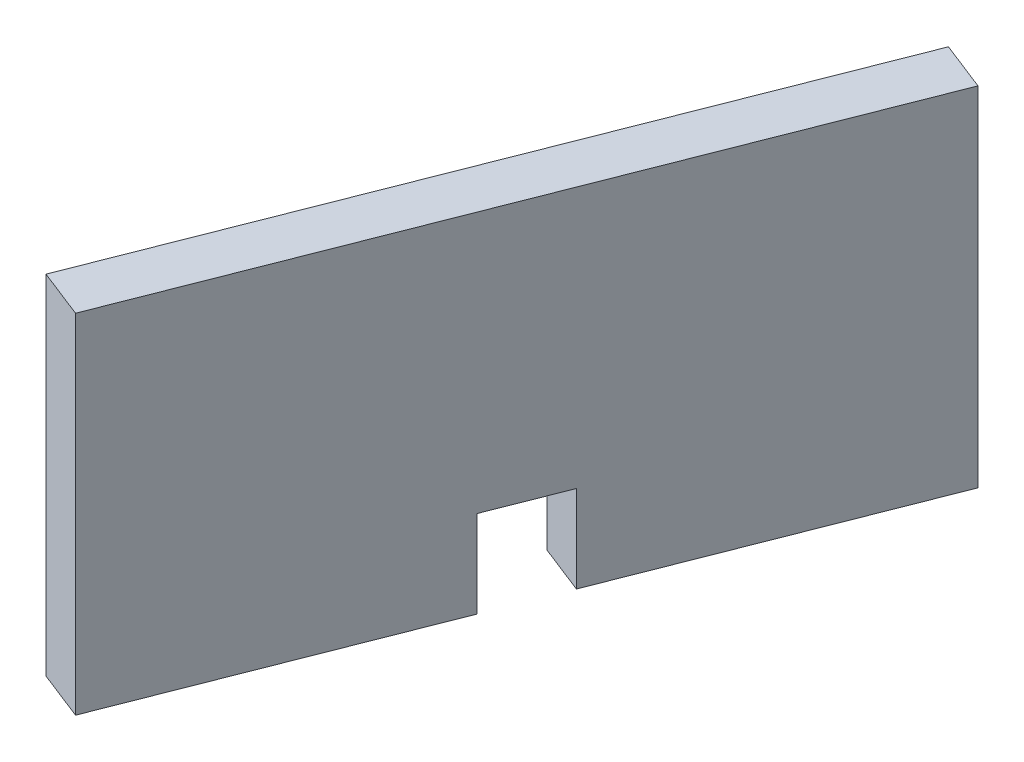
ISO-10303-21;
HEADER;
FILE_DESCRIPTION(('STEP AP214'),'2;1');
FILE_NAME('part.step','',(''),(''),'','','');
FILE_SCHEMA(('AUTOMOTIVE_DESIGN { 1 0 10303 214 1 1 1 1 }'));
ENDSEC;
DATA;
#1=APPLICATION_CONTEXT('core data for automotive mechanical design processes');
#2=APPLICATION_PROTOCOL_DEFINITION('international standard','automotive_design',2000,#1);
#3=PRODUCT_CONTEXT('',#1,'mechanical');
#4=PRODUCT('Part','Part','',(#3));
#5=PRODUCT_RELATED_PRODUCT_CATEGORY('part','',(#4));
#6=PRODUCT_DEFINITION_FORMATION('','',#4);
#7=PRODUCT_DEFINITION_CONTEXT('part definition',#1,'design');
#8=PRODUCT_DEFINITION('design','',#6,#7);
#9=PRODUCT_DEFINITION_SHAPE('','',#8);
#10=(LENGTH_UNIT() NAMED_UNIT(*) SI_UNIT(.MILLI.,.METRE.));
#11=(NAMED_UNIT(*) PLANE_ANGLE_UNIT() SI_UNIT($,.RADIAN.));
#12=(NAMED_UNIT(*) SI_UNIT($,.STERADIAN.) SOLID_ANGLE_UNIT());
#13=UNCERTAINTY_MEASURE_WITH_UNIT(LENGTH_MEASURE(1.E-05),#10,'distance_accuracy_value','');
#14=(GEOMETRIC_REPRESENTATION_CONTEXT(3) GLOBAL_UNCERTAINTY_ASSIGNED_CONTEXT((#13)) GLOBAL_UNIT_ASSIGNED_CONTEXT((#10,
#11,#12)) REPRESENTATION_CONTEXT('',''));
#15=CARTESIAN_POINT('',(0.,0.,0.));
#16=DIRECTION('',(0.,0.,1.));
#17=DIRECTION('',(1.,0.,0.));
#18=AXIS2_PLACEMENT_3D('',#15,#16,#17);
#19=CARTESIAN_POINT('',(43.5119887165098,200.000000000018,-90.3490832158114));
#20=DIRECTION('',(0.,0.999999999999994,2.17659222283696E-13));
#21=DIRECTION('',(0.930888575458414,-1.30395694242225E-13,0.36530324400573));
#22=AXIS2_PLACEMENT_3D('',#19,#20,#21);
#23=PLANE('',#22);
#24=DIRECTION('',(-0.365303244005823,-1.48298311564848E-13,0.930888575458446));
#25=VECTOR('',#24,1.);
#26=CARTESIAN_POINT('',(29.5486600846357,200.000000000025,-95.8286318758929));
#27=LINE('',#26,#25);
#28=CARTESIAN_POINT('',(-11.0000000000138,200.000000000015,7.4999999999974));
#29=VERTEX_POINT('',#28);
#30=CARTESIAN_POINT('',(-43.5119887165312,200.000000000017,90.3490832158025));
#31=VERTEX_POINT('',#30);
#32=EDGE_CURVE('E49',#29,#31,#27,.T.);
#33=ORIENTED_EDGE('',*,*,#32,.F.);
#34=DIRECTION('',(0.930888575458414,-1.30395694242225E-13,0.36530324400573));
#35=VECTOR('',#34,1.);
#36=CARTESIAN_POINT('',(-11.0000000000138,200.000000000015,7.4999999999974));
#37=LINE('',#36,#35);
#38=CARTESIAN_POINT('',(2.96332863186205,200.000000000004,12.9795486600816));
#39=VERTEX_POINT('',#38);
#40=EDGE_CURVE('E116',#29,#39,#37,.T.);
#41=ORIENTED_EDGE('',*,*,#40,.T.);
#42=DIRECTION('',(-0.365303244005823,-1.48298311564848E-13,0.930888575458446));
#43=VECTOR('',#42,1.);
#44=CARTESIAN_POINT('',(43.5119887165098,200.000000000018,-90.3490832158114));
#45=LINE('',#44,#43);
#46=CARTESIAN_POINT('',(-29.5486600846598,199.99999999998,95.8286318758849));
#47=VERTEX_POINT('',#46);
#48=EDGE_CURVE('E87',#39,#47,#45,.T.);
#49=ORIENTED_EDGE('',*,*,#48,.T.);
#50=DIRECTION('',(-0.930888575458414,1.30395694242225E-13,-0.36530324400573));
#51=VECTOR('',#50,1.);
#52=CARTESIAN_POINT('',(-29.5486600846598,199.99999999998,95.8286318758849));
#53=LINE('',#52,#51);
#54=EDGE_CURVE('E136',#47,#31,#53,.T.);
#55=ORIENTED_EDGE('',*,*,#54,.T.);
#56=EDGE_LOOP('',(#33,#41,#49,#55));
#57=FACE_BOUND('',#56,.T.);
#58=ADVANCED_FACE('F40',(#57),#23,.F.);
#59=CARTESIAN_POINT('',(43.5119887165098,200.000000000018,-90.3490832158114));
#60=VERTEX_POINT('',#59);
#61=CARTESIAN_POINT('',(10.9999999999851,199.99999999999,-7.50000000000539));
#62=VERTEX_POINT('',#61);
#63=EDGE_CURVE('E149',#60,#62,#45,.T.);
#64=ORIENTED_EDGE('',*,*,#63,.T.);
#65=DIRECTION('',(0.930888575458414,-1.30395694242225E-13,0.36530324400573));
#66=VECTOR('',#65,1.);
#67=CARTESIAN_POINT('',(-2.96332863188514,200.000000000013,-12.9795486600867));
#68=LINE('',#67,#66);
#69=CARTESIAN_POINT('',(-2.96332863188514,200.000000000013,-12.9795486600867));
#70=VERTEX_POINT('',#69);
#71=EDGE_CURVE('E56',#70,#62,#68,.T.);
#72=ORIENTED_EDGE('',*,*,#71,.F.);
#73=CARTESIAN_POINT('',(29.5486600846357,200.000000000025,-95.8286318758929));
#74=VERTEX_POINT('',#73);
#75=EDGE_CURVE('E11',#74,#70,#27,.T.);
#76=ORIENTED_EDGE('',*,*,#75,.F.);
#77=DIRECTION('',(-0.930888575458414,1.30395694242225E-13,-0.36530324400573));
#78=VECTOR('',#77,1.);
#79=CARTESIAN_POINT('',(43.5119887165098,200.000000000018,-90.3490832158114));
#80=LINE('',#79,#78);
#81=EDGE_CURVE('E158',#60,#74,#80,.T.);
#82=ORIENTED_EDGE('',*,*,#81,.F.);
#83=EDGE_LOOP('',(#64,#72,#76,#82));
#84=FACE_BOUND('',#83,.T.);
#85=ADVANCED_FACE('F42',(#84),#23,.F.);
#86=CARTESIAN_POINT('',(29.5486600846357,200.000000000025,-95.8286318758929));
#87=DIRECTION('',(0.930888575458414,-1.30395694242225E-13,0.36530324400573));
#88=DIRECTION('',(0.365303244005823,1.48298311564848E-13,-0.930888575458446));
#89=AXIS2_PLACEMENT_3D('',#86,#87,#88);
#90=PLANE('',#89);
#91=DIRECTION('',(-0.365303244005823,-1.48298311564848E-13,0.930888575458446));
#92=VECTOR('',#91,1.);
#93=CARTESIAN_POINT('',(-11.0000000000101,225.000000000002,7.49999999999662));
#94=LINE('',#93,#92);
#95=CARTESIAN_POINT('',(-2.96332863187349,225.000000000001,-12.9795486600831));
#96=VERTEX_POINT('',#95);
#97=CARTESIAN_POINT('',(-11.0000000000101,225.000000000002,7.49999999999662));
#98=VERTEX_POINT('',#97);
#99=EDGE_CURVE('E125',#96,#98,#94,.T.);
#100=ORIENTED_EDGE('',*,*,#99,.T.);
#101=DIRECTION('',(0.,-0.999999999999994,-2.17659222283696E-13));
#102=VECTOR('',#101,1.);
#103=CARTESIAN_POINT('',(-11.0000000000138,200.000000000015,7.4999999999974));
#104=LINE('',#103,#102);
#105=EDGE_CURVE('E119',#98,#29,#104,.T.);
#106=ORIENTED_EDGE('',*,*,#105,.T.);
#107=ORIENTED_EDGE('',*,*,#32,.T.);
#108=DIRECTION('',(0.,0.999999999999994,2.17659222283696E-13));
#109=VECTOR('',#108,1.);
#110=CARTESIAN_POINT('',(-43.5119887165312,200.000000000017,90.3490832158025));
#111=LINE('',#110,#109);
#112=CARTESIAN_POINT('',(-43.511988716535,299.999999999983,90.3490832158192));
#113=VERTEX_POINT('',#112);
#114=EDGE_CURVE('E162',#31,#113,#111,.T.);
#115=ORIENTED_EDGE('',*,*,#114,.T.);
#116=DIRECTION('',(-0.365303244005823,-1.48298311564848E-13,0.930888575458446));
#117=VECTOR('',#116,1.);
#118=CARTESIAN_POINT('',(29.5486600846361,300.000000000021,-95.8286318758704));
#119=LINE('',#118,#117);
#120=CARTESIAN_POINT('',(29.5486600846361,300.000000000021,-95.8286318758704));
#121=VERTEX_POINT('',#120);
#122=EDGE_CURVE('E138',#121,#113,#119,.T.);
#123=ORIENTED_EDGE('',*,*,#122,.F.);
#124=DIRECTION('',(0.,0.999999999999994,2.17659222283696E-13));
#125=VECTOR('',#124,1.);
#126=CARTESIAN_POINT('',(29.5486600846357,200.000000000025,-95.8286318758929));
#127=LINE('',#126,#125);
#128=EDGE_CURVE('E94',#74,#121,#127,.T.);
#129=ORIENTED_EDGE('',*,*,#128,.F.);
#130=ORIENTED_EDGE('',*,*,#75,.T.);
#131=DIRECTION('',(0.,0.999999999999996,2.1865842639399E-13));
#132=VECTOR('',#131,1.);
#133=CARTESIAN_POINT('',(-2.96332863188514,200.000000000013,-12.9795486600867));
#134=LINE('',#133,#132);
#135=EDGE_CURVE('E132',#70,#96,#134,.T.);
#136=ORIENTED_EDGE('',*,*,#135,.T.);
#137=EDGE_LOOP('',(#100,#106,#107,#115,#123,#129,#130,#136));
#138=FACE_BOUND('',#137,.T.);
#139=ADVANCED_FACE('F127',(#138),#90,.F.);
#140=CARTESIAN_POINT('',(43.5119887165228,300.000000000016,-90.3490832157818));
#141=DIRECTION('',(0.,-0.999999999999994,-2.17659222283696E-13));
#142=DIRECTION('',(-0.930888575458414,1.30395694242225E-13,-0.36530324400573));
#143=AXIS2_PLACEMENT_3D('',#140,#141,#142);
#144=PLANE('',#143);
#145=DIRECTION('',(0.930888575458414,-1.30395694242225E-13,0.36530324400573));
#146=VECTOR('',#145,1.);
#147=CARTESIAN_POINT('',(-29.5486600846474,299.999999999995,95.8286318759029));
#148=LINE('',#147,#146);
#149=CARTESIAN_POINT('',(-29.5486600846474,299.999999999995,95.8286318759029));
#150=VERTEX_POINT('',#149);
#151=EDGE_CURVE('E159',#113,#150,#148,.T.);
#152=ORIENTED_EDGE('',*,*,#151,.T.);
#153=DIRECTION('',(-0.365303244005823,-1.48298311564848E-13,0.930888575458446));
#154=VECTOR('',#153,1.);
#155=CARTESIAN_POINT('',(43.5119887165228,300.000000000016,-90.3490832157818));
#156=LINE('',#155,#154);
#157=CARTESIAN_POINT('',(43.5119887165228,300.000000000016,-90.3490832157818));
#158=VERTEX_POINT('',#157);
#159=EDGE_CURVE('E142',#158,#150,#156,.T.);
#160=ORIENTED_EDGE('',*,*,#159,.F.);
#161=DIRECTION('',(0.930888575458414,-1.30395694242225E-13,0.36530324400573));
#162=VECTOR('',#161,1.);
#163=CARTESIAN_POINT('',(43.5119887165228,300.000000000016,-90.3490832157818));
#164=LINE('',#163,#162);
#165=EDGE_CURVE('E170',#121,#158,#164,.T.);
#166=ORIENTED_EDGE('',*,*,#165,.F.);
#167=ORIENTED_EDGE('',*,*,#122,.T.);
#168=EDGE_LOOP('',(#152,#160,#166,#167));
#169=FACE_BOUND('',#168,.T.);
#170=ADVANCED_FACE('F222',(#169),#144,.F.);
#171=CARTESIAN_POINT('',(43.5119887165098,200.000000000018,-90.3490832158114));
#172=DIRECTION('',(-0.930888575458414,1.30395694242225E-13,-0.36530324400573));
#173=DIRECTION('',(-0.365303244005823,-1.48298311564848E-13,0.930888575458446));
#174=AXIS2_PLACEMENT_3D('',#171,#172,#173);
#175=PLANE('',#174);
#176=ORIENTED_EDGE('',*,*,#48,.F.);
#177=DIRECTION('',(0.,-0.999999999999994,-2.17659222283696E-13));
#178=VECTOR('',#177,1.);
#179=CARTESIAN_POINT('',(2.96332863186205,200.000000000004,12.9795486600816));
#180=LINE('',#179,#178);
#181=CARTESIAN_POINT('',(2.96332863185789,225.000000000007,12.9795486600827));
#182=VERTEX_POINT('',#181);
#183=EDGE_CURVE('E122',#182,#39,#180,.T.);
#184=ORIENTED_EDGE('',*,*,#183,.F.);
#185=DIRECTION('',(-0.365303244005823,-1.48298311564848E-13,0.930888575458446));
#186=VECTOR('',#185,1.);
#187=CARTESIAN_POINT('',(2.96332863185789,225.000000000007,12.9795486600827));
#188=LINE('',#187,#186);
#189=CARTESIAN_POINT('',(10.999999999986,225.000000000014,-7.50000000000361));
#190=VERTEX_POINT('',#189);
#191=EDGE_CURVE('E133',#190,#182,#188,.T.);
#192=ORIENTED_EDGE('',*,*,#191,.F.);
#193=DIRECTION('',(0.,0.999999999999996,2.1865842639399E-13));
#194=VECTOR('',#193,1.);
#195=CARTESIAN_POINT('',(10.9999999999851,199.99999999999,-7.50000000000539));
#196=LINE('',#195,#194);
#197=EDGE_CURVE('E187',#62,#190,#196,.T.);
#198=ORIENTED_EDGE('',*,*,#197,.F.);
#199=ORIENTED_EDGE('',*,*,#63,.F.);
#200=DIRECTION('',(0.,-0.999999999999994,-2.17659222283696E-13));
#201=VECTOR('',#200,1.);
#202=CARTESIAN_POINT('',(43.5119887165098,200.000000000018,-90.3490832158114));
#203=LINE('',#202,#201);
#204=EDGE_CURVE('E65',#158,#60,#203,.T.);
#205=ORIENTED_EDGE('',*,*,#204,.F.);
#206=ORIENTED_EDGE('',*,*,#159,.T.);
#207=DIRECTION('',(0.,-0.999999999999994,-2.17659222283696E-13));
#208=VECTOR('',#207,1.);
#209=CARTESIAN_POINT('',(-29.5486600846598,199.99999999998,95.8286318758849));
#210=LINE('',#209,#208);
#211=EDGE_CURVE('E155',#150,#47,#210,.T.);
#212=ORIENTED_EDGE('',*,*,#211,.T.);
#213=EDGE_LOOP('',(#176,#184,#192,#198,#199,#205,#206,#212));
#214=FACE_BOUND('',#213,.T.);
#215=ADVANCED_FACE('F202',(#214),#175,.F.);
#216=CARTESIAN_POINT('',(29.5486600846357,200.000000000025,-95.8286318758929));
#217=DIRECTION('',(0.365303244005823,1.48298311564848E-13,-0.930888575458446));
#218=DIRECTION('',(-0.930888575458414,1.30395694242225E-13,-0.36530324400573));
#219=AXIS2_PLACEMENT_3D('',#216,#217,#218);
#220=PLANE('',#219);
#221=ORIENTED_EDGE('',*,*,#81,.T.);
#222=ORIENTED_EDGE('',*,*,#128,.T.);
#223=ORIENTED_EDGE('',*,*,#165,.T.);
#224=ORIENTED_EDGE('',*,*,#204,.T.);
#225=EDGE_LOOP('',(#221,#222,#223,#224));
#226=FACE_BOUND('',#225,.T.);
#227=ADVANCED_FACE('F230',(#226),#220,.T.);
#228=CARTESIAN_POINT('',(-43.5119887165312,200.000000000017,90.3490832158025));
#229=DIRECTION('',(0.365303244005823,1.48298311564848E-13,-0.930888575458446));
#230=DIRECTION('',(-0.930888575458414,1.30395694242225E-13,-0.36530324400573));
#231=AXIS2_PLACEMENT_3D('',#228,#229,#230);
#232=PLANE('',#231);
#233=ORIENTED_EDGE('',*,*,#54,.F.);
#234=ORIENTED_EDGE('',*,*,#211,.F.);
#235=ORIENTED_EDGE('',*,*,#151,.F.);
#236=ORIENTED_EDGE('',*,*,#114,.F.);
#237=EDGE_LOOP('',(#233,#234,#235,#236));
#238=FACE_BOUND('',#237,.T.);
#239=ADVANCED_FACE('F213',(#238),#232,.F.);
#240=CARTESIAN_POINT('',(-11.0000000000138,200.000000000015,7.4999999999974));
#241=DIRECTION('',(-0.365303244005823,-1.48298311564848E-13,0.930888575458446));
#242=DIRECTION('',(0.930888575458414,-1.30395694242225E-13,0.36530324400573));
#243=AXIS2_PLACEMENT_3D('',#240,#241,#242);
#244=PLANE('',#243);
#245=ORIENTED_EDGE('',*,*,#183,.T.);
#246=ORIENTED_EDGE('',*,*,#40,.F.);
#247=ORIENTED_EDGE('',*,*,#105,.F.);
#248=DIRECTION('',(0.930888575458414,-1.30395694242225E-13,0.36530324400573));
#249=VECTOR('',#248,1.);
#250=CARTESIAN_POINT('',(-11.0000000000101,225.000000000002,7.49999999999662));
#251=LINE('',#250,#249);
#252=EDGE_CURVE('E167',#98,#182,#251,.T.);
#253=ORIENTED_EDGE('',*,*,#252,.T.);
#254=EDGE_LOOP('',(#245,#246,#247,#253));
#255=FACE_BOUND('',#254,.T.);
#256=ADVANCED_FACE('F118',(#255),#244,.F.);
#257=CARTESIAN_POINT('',(-11.0000000000101,225.000000000002,7.49999999999662));
#258=DIRECTION('',(0.,0.999999999999994,2.17659222283696E-13));
#259=DIRECTION('',(0.930888575458414,-1.30395694242225E-13,0.36530324400573));
#260=AXIS2_PLACEMENT_3D('',#257,#258,#259);
#261=PLANE('',#260);
#262=ORIENTED_EDGE('',*,*,#191,.T.);
#263=ORIENTED_EDGE('',*,*,#252,.F.);
#264=ORIENTED_EDGE('',*,*,#99,.F.);
#265=DIRECTION('',(0.930888575458414,-1.30395694242225E-13,0.36530324400573));
#266=VECTOR('',#265,1.);
#267=CARTESIAN_POINT('',(-2.96332863187349,225.000000000001,-12.9795486600831));
#268=LINE('',#267,#266);
#269=EDGE_CURVE('E179',#96,#190,#268,.T.);
#270=ORIENTED_EDGE('',*,*,#269,.T.);
#271=EDGE_LOOP('',(#262,#263,#264,#270));
#272=FACE_BOUND('',#271,.T.);
#273=ADVANCED_FACE('F205',(#272),#261,.F.);
#274=CARTESIAN_POINT('',(-2.96332863188514,200.000000000013,-12.9795486600867));
#275=DIRECTION('',(0.365303244005826,1.47382431779641E-13,-0.930888575458451));
#276=DIRECTION('',(0.,0.999999999999996,2.1865842639399E-13));
#277=AXIS2_PLACEMENT_3D('',#274,#275,#276);
#278=PLANE('',#277);
#279=ORIENTED_EDGE('',*,*,#197,.T.);
#280=ORIENTED_EDGE('',*,*,#269,.F.);
#281=ORIENTED_EDGE('',*,*,#135,.F.);
#282=ORIENTED_EDGE('',*,*,#71,.T.);
#283=EDGE_LOOP('',(#279,#280,#281,#282));
#284=FACE_BOUND('',#283,.T.);
#285=ADVANCED_FACE('F198',(#284),#278,.F.);
#286=CLOSED_SHELL('',(#58,#85,#139,#170,#215,#227,#239,#256,#273,#285));
#287=MANIFOLD_SOLID_BREP('B2',#286);
#288=ADVANCED_BREP_SHAPE_REPRESENTATION('',(#18,#287),#14);
#289=SHAPE_DEFINITION_REPRESENTATION(#9,#288);
ENDSEC;
END-ISO-10303-21;
